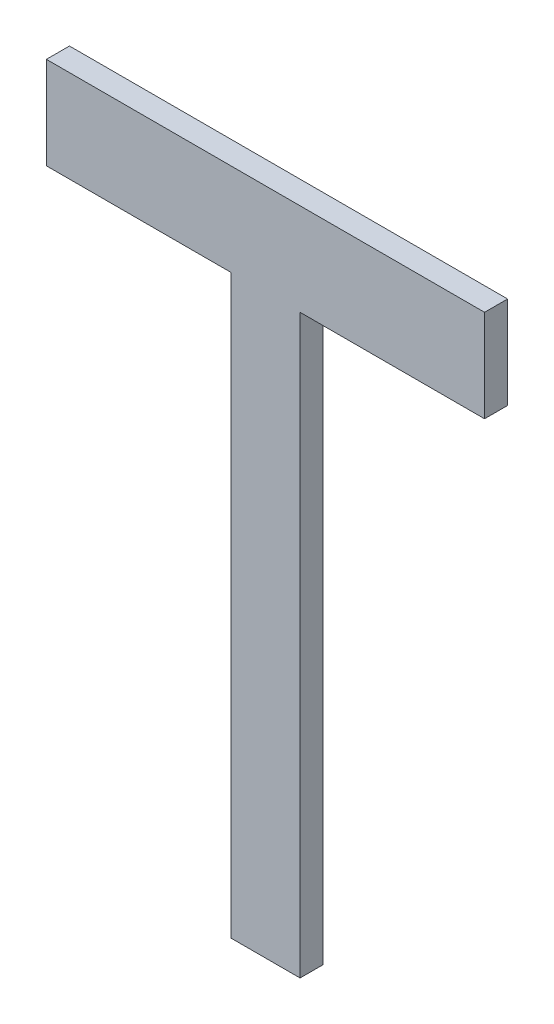
ISO-10303-21;
HEADER;
FILE_DESCRIPTION(('STEP AP214'),'2;1');
FILE_NAME('part.step','',(''),(''),'','','');
FILE_SCHEMA(('AUTOMOTIVE_DESIGN { 1 0 10303 214 1 1 1 1 }'));
ENDSEC;
DATA;
#1=APPLICATION_CONTEXT('core data for automotive mechanical design processes');
#2=APPLICATION_PROTOCOL_DEFINITION('international standard','automotive_design',2000,#1);
#3=PRODUCT_CONTEXT('',#1,'mechanical');
#4=PRODUCT('Part','Part','',(#3));
#5=PRODUCT_RELATED_PRODUCT_CATEGORY('part','',(#4));
#6=PRODUCT_DEFINITION_FORMATION('','',#4);
#7=PRODUCT_DEFINITION_CONTEXT('part definition',#1,'design');
#8=PRODUCT_DEFINITION('design','',#6,#7);
#9=PRODUCT_DEFINITION_SHAPE('','',#8);
#10=(LENGTH_UNIT() NAMED_UNIT(*) SI_UNIT(.MILLI.,.METRE.));
#11=(NAMED_UNIT(*) PLANE_ANGLE_UNIT() SI_UNIT($,.RADIAN.));
#12=(NAMED_UNIT(*) SI_UNIT($,.STERADIAN.) SOLID_ANGLE_UNIT());
#13=UNCERTAINTY_MEASURE_WITH_UNIT(LENGTH_MEASURE(1.E-05),#10,'distance_accuracy_value','');
#14=(GEOMETRIC_REPRESENTATION_CONTEXT(3) GLOBAL_UNCERTAINTY_ASSIGNED_CONTEXT((#13)) GLOBAL_UNIT_ASSIGNED_CONTEXT((#10,
#11,#12)) REPRESENTATION_CONTEXT('',''));
#15=CARTESIAN_POINT('',(0.,0.,0.));
#16=DIRECTION('',(0.,0.,1.));
#17=DIRECTION('',(1.,0.,0.));
#18=AXIS2_PLACEMENT_3D('',#15,#16,#17);
#19=CARTESIAN_POINT('',(-0.09499854000001,0.14500098,0.01));
#20=DIRECTION('',(0.,0.,-1.));
#21=DIRECTION('',(-1.,0.,0.));
#22=AXIS2_PLACEMENT_3D('',#19,#20,#21);
#23=PLANE('',#22);
#24=DIRECTION('',(1.,0.,0.));
#25=VECTOR('',#24,1.);
#26=CARTESIAN_POINT('',(-0.09499854000001,0.10500106,0.01));
#27=LINE('',#26,#25);
#28=CARTESIAN_POINT('',(-0.09499854000001,0.10500106,0.01));
#29=VERTEX_POINT('',#28);
#30=CARTESIAN_POINT('',(-0.01499870000001,0.10500106,0.01));
#31=VERTEX_POINT('',#30);
#32=EDGE_CURVE('E131',#29,#31,#27,.T.);
#33=ORIENTED_EDGE('',*,*,#32,.T.);
#34=DIRECTION('',(0.,1.,0.));
#35=VECTOR('',#34,1.);
#36=CARTESIAN_POINT('',(-0.01499870000001,0.10500106,0.01));
#37=LINE('',#36,#35);
#38=CARTESIAN_POINT('',(-0.01499870000001,-0.14499844,0.01));
#39=VERTEX_POINT('',#38);
#40=EDGE_CURVE('E125',#31,#39,#37,.F.);
#41=ORIENTED_EDGE('',*,*,#40,.T.);
#42=DIRECTION('',(1.,0.,0.));
#43=VECTOR('',#42,1.);
#44=CARTESIAN_POINT('',(-0.01499870000001,-0.14499844,0.01));
#45=LINE('',#44,#43);
#46=CARTESIAN_POINT('',(0.01500124,-0.14499844,0.01));
#47=VERTEX_POINT('',#46);
#48=EDGE_CURVE('E119',#39,#47,#45,.T.);
#49=ORIENTED_EDGE('',*,*,#48,.T.);
#50=DIRECTION('',(0.,1.,0.));
#51=VECTOR('',#50,1.);
#52=CARTESIAN_POINT('',(0.01500124,-0.14499844,0.01));
#53=LINE('',#52,#51);
#54=CARTESIAN_POINT('',(0.01500124,0.10500106,0.01));
#55=VERTEX_POINT('',#54);
#56=EDGE_CURVE('E113',#47,#55,#53,.T.);
#57=ORIENTED_EDGE('',*,*,#56,.T.);
#58=DIRECTION('',(1.,0.,0.));
#59=VECTOR('',#58,1.);
#60=CARTESIAN_POINT('',(0.01500124,0.10500106,0.01));
#61=LINE('',#60,#59);
#62=CARTESIAN_POINT('',(0.09500108,0.10500106,0.01));
#63=VERTEX_POINT('',#62);
#64=EDGE_CURVE('E80',#55,#63,#61,.T.);
#65=ORIENTED_EDGE('',*,*,#64,.T.);
#66=DIRECTION('',(0.,1.,0.));
#67=VECTOR('',#66,1.);
#68=CARTESIAN_POINT('',(0.09500108,0.10500106,0.01));
#69=LINE('',#68,#67);
#70=CARTESIAN_POINT('',(0.09500108,0.14500098,0.01));
#71=VERTEX_POINT('',#70);
#72=EDGE_CURVE('E82',#63,#71,#69,.T.);
#73=ORIENTED_EDGE('',*,*,#72,.T.);
#74=DIRECTION('',(1.,0.,0.));
#75=VECTOR('',#74,1.);
#76=CARTESIAN_POINT('',(0.09500108,0.14500098,0.01));
#77=LINE('',#76,#75);
#78=CARTESIAN_POINT('',(-0.09499854000001,0.14500098,0.01));
#79=VERTEX_POINT('',#78);
#80=EDGE_CURVE('E19',#71,#79,#77,.F.);
#81=ORIENTED_EDGE('',*,*,#80,.T.);
#82=DIRECTION('',(0.,1.,0.));
#83=VECTOR('',#82,1.);
#84=CARTESIAN_POINT('',(-0.09499854000001,0.14500098,0.01));
#85=LINE('',#84,#83);
#86=EDGE_CURVE('E138',#79,#29,#85,.F.);
#87=ORIENTED_EDGE('',*,*,#86,.T.);
#88=EDGE_LOOP('',(#33,#41,#49,#57,#65,#73,#81,#87));
#89=FACE_BOUND('',#88,.T.);
#90=ADVANCED_FACE('F16',(#89),#23,.F.);
#91=CARTESIAN_POINT('',(0.09500108,0.14500098,0.));
#92=DIRECTION('',(0.,-1.,0.));
#93=DIRECTION('',(0.,0.,-1.));
#94=AXIS2_PLACEMENT_3D('',#91,#92,#93);
#95=PLANE('',#94);
#96=DIRECTION('',(0.,0.,-1.));
#97=VECTOR('',#96,1.);
#98=CARTESIAN_POINT('',(-0.09499854000001,0.14500098,0.));
#99=LINE('',#98,#97);
#100=CARTESIAN_POINT('',(-0.09499854000001,0.14500098,0.));
#101=VERTEX_POINT('',#100);
#102=EDGE_CURVE('E94',#101,#79,#99,.F.);
#103=ORIENTED_EDGE('',*,*,#102,.T.);
#104=ORIENTED_EDGE('',*,*,#80,.F.);
#105=DIRECTION('',(0.,0.,1.));
#106=VECTOR('',#105,1.);
#107=CARTESIAN_POINT('',(0.09500108,0.14500098,0.));
#108=LINE('',#107,#106);
#109=CARTESIAN_POINT('',(0.09500108,0.14500098,0.));
#110=VERTEX_POINT('',#109);
#111=EDGE_CURVE('E89',#71,#110,#108,.F.);
#112=ORIENTED_EDGE('',*,*,#111,.T.);
#113=DIRECTION('',(-1.,0.,0.));
#114=VECTOR('',#113,1.);
#115=CARTESIAN_POINT('',(-0.09499854000001,0.14500098,0.));
#116=LINE('',#115,#114);
#117=EDGE_CURVE('E143',#101,#110,#116,.F.);
#118=ORIENTED_EDGE('',*,*,#117,.F.);
#119=EDGE_LOOP('',(#103,#104,#112,#118));
#120=FACE_BOUND('',#119,.T.);
#121=ADVANCED_FACE('F91',(#120),#95,.F.);
#122=CARTESIAN_POINT('',(0.09500108,0.10500106,0.));
#123=DIRECTION('',(-1.,0.,0.));
#124=DIRECTION('',(0.,0.,1.));
#125=AXIS2_PLACEMENT_3D('',#122,#123,#124);
#126=PLANE('',#125);
#127=ORIENTED_EDGE('',*,*,#111,.F.);
#128=ORIENTED_EDGE('',*,*,#72,.F.);
#129=DIRECTION('',(0.,0.,1.));
#130=VECTOR('',#129,1.);
#131=CARTESIAN_POINT('',(0.09500108,0.10500106,0.));
#132=LINE('',#131,#130);
#133=CARTESIAN_POINT('',(0.09500108,0.10500106,0.));
#134=VERTEX_POINT('',#133);
#135=EDGE_CURVE('E108',#63,#134,#132,.F.);
#136=ORIENTED_EDGE('',*,*,#135,.T.);
#137=DIRECTION('',(0.,1.,0.));
#138=VECTOR('',#137,1.);
#139=CARTESIAN_POINT('',(0.09500108,0.14500098,0.));
#140=LINE('',#139,#138);
#141=EDGE_CURVE('E99',#110,#134,#140,.F.);
#142=ORIENTED_EDGE('',*,*,#141,.F.);
#143=EDGE_LOOP('',(#127,#128,#136,#142));
#144=FACE_BOUND('',#143,.T.);
#145=ADVANCED_FACE('F97',(#144),#126,.F.);
#146=CARTESIAN_POINT('',(0.01500124,0.10500106,0.));
#147=DIRECTION('',(0.,1.,0.));
#148=DIRECTION('',(0.,0.,1.));
#149=AXIS2_PLACEMENT_3D('',#146,#147,#148);
#150=PLANE('',#149);
#151=ORIENTED_EDGE('',*,*,#135,.F.);
#152=ORIENTED_EDGE('',*,*,#64,.F.);
#153=DIRECTION('',(0.,0.,1.));
#154=VECTOR('',#153,1.);
#155=CARTESIAN_POINT('',(0.01500124,0.10500106,0.));
#156=LINE('',#155,#154);
#157=CARTESIAN_POINT('',(0.01500124,0.10500106,0.));
#158=VERTEX_POINT('',#157);
#159=EDGE_CURVE('E116',#55,#158,#156,.F.);
#160=ORIENTED_EDGE('',*,*,#159,.T.);
#161=DIRECTION('',(-1.,0.,0.));
#162=VECTOR('',#161,1.);
#163=CARTESIAN_POINT('',(-0.09499854000001,0.10500106,0.));
#164=LINE('',#163,#162);
#165=EDGE_CURVE('E147',#134,#158,#164,.T.);
#166=ORIENTED_EDGE('',*,*,#165,.F.);
#167=EDGE_LOOP('',(#151,#152,#160,#166));
#168=FACE_BOUND('',#167,.T.);
#169=ADVANCED_FACE('F186',(#168),#150,.F.);
#170=CARTESIAN_POINT('',(0.01500124,-0.14499844,0.));
#171=DIRECTION('',(-1.,0.,0.));
#172=DIRECTION('',(0.,0.,1.));
#173=AXIS2_PLACEMENT_3D('',#170,#171,#172);
#174=PLANE('',#173);
#175=ORIENTED_EDGE('',*,*,#159,.F.);
#176=ORIENTED_EDGE('',*,*,#56,.F.);
#177=DIRECTION('',(0.,0.,1.));
#178=VECTOR('',#177,1.);
#179=CARTESIAN_POINT('',(0.01500124,-0.14499844,0.));
#180=LINE('',#179,#178);
#181=CARTESIAN_POINT('',(0.01500124,-0.14499844,0.));
#182=VERTEX_POINT('',#181);
#183=EDGE_CURVE('E122',#47,#182,#180,.F.);
#184=ORIENTED_EDGE('',*,*,#183,.T.);
#185=DIRECTION('',(0.,1.,0.));
#186=VECTOR('',#185,1.);
#187=CARTESIAN_POINT('',(0.01500124,0.14500098,0.));
#188=LINE('',#187,#186);
#189=EDGE_CURVE('E151',#158,#182,#188,.F.);
#190=ORIENTED_EDGE('',*,*,#189,.F.);
#191=EDGE_LOOP('',(#175,#176,#184,#190));
#192=FACE_BOUND('',#191,.T.);
#193=ADVANCED_FACE('F184',(#192),#174,.F.);
#194=CARTESIAN_POINT('',(-0.01499870000001,-0.14499844,0.));
#195=DIRECTION('',(0.,1.,0.));
#196=DIRECTION('',(0.,0.,1.));
#197=AXIS2_PLACEMENT_3D('',#194,#195,#196);
#198=PLANE('',#197);
#199=ORIENTED_EDGE('',*,*,#183,.F.);
#200=ORIENTED_EDGE('',*,*,#48,.F.);
#201=DIRECTION('',(0.,0.,-1.));
#202=VECTOR('',#201,1.);
#203=CARTESIAN_POINT('',(-0.01499870000001,-0.14499844,0.));
#204=LINE('',#203,#202);
#205=CARTESIAN_POINT('',(-0.01499870000001,-0.14499844,0.));
#206=VERTEX_POINT('',#205);
#207=EDGE_CURVE('E128',#39,#206,#204,.T.);
#208=ORIENTED_EDGE('',*,*,#207,.T.);
#209=DIRECTION('',(-1.,0.,0.));
#210=VECTOR('',#209,1.);
#211=CARTESIAN_POINT('',(-0.09499854000001,-0.14499844,0.));
#212=LINE('',#211,#210);
#213=EDGE_CURVE('E155',#182,#206,#212,.T.);
#214=ORIENTED_EDGE('',*,*,#213,.F.);
#215=EDGE_LOOP('',(#199,#200,#208,#214));
#216=FACE_BOUND('',#215,.T.);
#217=ADVANCED_FACE('F179',(#216),#198,.F.);
#218=CARTESIAN_POINT('',(-0.01499870000001,0.10500106,0.));
#219=DIRECTION('',(1.,0.,0.));
#220=DIRECTION('',(0.,0.,-1.));
#221=AXIS2_PLACEMENT_3D('',#218,#219,#220);
#222=PLANE('',#221);
#223=ORIENTED_EDGE('',*,*,#207,.F.);
#224=ORIENTED_EDGE('',*,*,#40,.F.);
#225=DIRECTION('',(0.,0.,1.));
#226=VECTOR('',#225,1.);
#227=CARTESIAN_POINT('',(-0.01499870000001,0.10500106,0.));
#228=LINE('',#227,#226);
#229=CARTESIAN_POINT('',(-0.01499870000001,0.10500106,0.));
#230=VERTEX_POINT('',#229);
#231=EDGE_CURVE('E133',#31,#230,#228,.F.);
#232=ORIENTED_EDGE('',*,*,#231,.T.);
#233=DIRECTION('',(0.,1.,0.));
#234=VECTOR('',#233,1.);
#235=CARTESIAN_POINT('',(-0.01499870000001,0.14500098,0.));
#236=LINE('',#235,#234);
#237=EDGE_CURVE('E159',#206,#230,#236,.T.);
#238=ORIENTED_EDGE('',*,*,#237,.F.);
#239=EDGE_LOOP('',(#223,#224,#232,#238));
#240=FACE_BOUND('',#239,.T.);
#241=ADVANCED_FACE('F174',(#240),#222,.F.);
#242=CARTESIAN_POINT('',(-0.09499854000001,0.10500106,0.));
#243=DIRECTION('',(0.,1.,0.));
#244=DIRECTION('',(0.,0.,1.));
#245=AXIS2_PLACEMENT_3D('',#242,#243,#244);
#246=PLANE('',#245);
#247=ORIENTED_EDGE('',*,*,#231,.F.);
#248=ORIENTED_EDGE('',*,*,#32,.F.);
#249=DIRECTION('',(0.,0.,-1.));
#250=VECTOR('',#249,1.);
#251=CARTESIAN_POINT('',(-0.09499854000001,0.10500106,0.));
#252=LINE('',#251,#250);
#253=CARTESIAN_POINT('',(-0.09499854000001,0.10500106,0.));
#254=VERTEX_POINT('',#253);
#255=EDGE_CURVE('E35',#29,#254,#252,.T.);
#256=ORIENTED_EDGE('',*,*,#255,.T.);
#257=DIRECTION('',(-1.,0.,0.));
#258=VECTOR('',#257,1.);
#259=CARTESIAN_POINT('',(-0.09499854000001,0.10500106,0.));
#260=LINE('',#259,#258);
#261=EDGE_CURVE('E26',#230,#254,#260,.T.);
#262=ORIENTED_EDGE('',*,*,#261,.F.);
#263=EDGE_LOOP('',(#247,#248,#256,#262));
#264=FACE_BOUND('',#263,.T.);
#265=ADVANCED_FACE('F170',(#264),#246,.F.);
#266=CARTESIAN_POINT('',(-0.09499854000001,0.14500098,0.));
#267=DIRECTION('',(1.,0.,0.));
#268=DIRECTION('',(0.,0.,-1.));
#269=AXIS2_PLACEMENT_3D('',#266,#267,#268);
#270=PLANE('',#269);
#271=ORIENTED_EDGE('',*,*,#255,.F.);
#272=ORIENTED_EDGE('',*,*,#86,.F.);
#273=ORIENTED_EDGE('',*,*,#102,.F.);
#274=DIRECTION('',(0.,1.,0.));
#275=VECTOR('',#274,1.);
#276=CARTESIAN_POINT('',(-0.09499854000001,0.14500098,0.));
#277=LINE('',#276,#275);
#278=EDGE_CURVE('E11',#254,#101,#277,.T.);
#279=ORIENTED_EDGE('',*,*,#278,.F.);
#280=EDGE_LOOP('',(#271,#272,#273,#279));
#281=FACE_BOUND('',#280,.T.);
#282=ADVANCED_FACE('F189',(#281),#270,.F.);
#283=CARTESIAN_POINT('',(-0.09499854000001,0.14500098,0.));
#284=DIRECTION('',(0.,0.,-1.));
#285=DIRECTION('',(-1.,0.,0.));
#286=AXIS2_PLACEMENT_3D('',#283,#284,#285);
#287=PLANE('',#286);
#288=ORIENTED_EDGE('',*,*,#261,.T.);
#289=ORIENTED_EDGE('',*,*,#278,.T.);
#290=ORIENTED_EDGE('',*,*,#117,.T.);
#291=ORIENTED_EDGE('',*,*,#141,.T.);
#292=ORIENTED_EDGE('',*,*,#165,.T.);
#293=ORIENTED_EDGE('',*,*,#189,.T.);
#294=ORIENTED_EDGE('',*,*,#213,.T.);
#295=ORIENTED_EDGE('',*,*,#237,.T.);
#296=EDGE_LOOP('',(#288,#289,#290,#291,#292,#293,#294,#295));
#297=FACE_BOUND('',#296,.T.);
#298=ADVANCED_FACE('F167',(#297),#287,.T.);
#299=CLOSED_SHELL('',(#90,#121,#145,#169,#193,#217,#241,#265,#282,#298));
#300=MANIFOLD_SOLID_BREP('B1',#299);
#301=ADVANCED_BREP_SHAPE_REPRESENTATION('',(#18,#300),#14);
#302=SHAPE_DEFINITION_REPRESENTATION(#9,#301);
ENDSEC;
END-ISO-10303-21;
